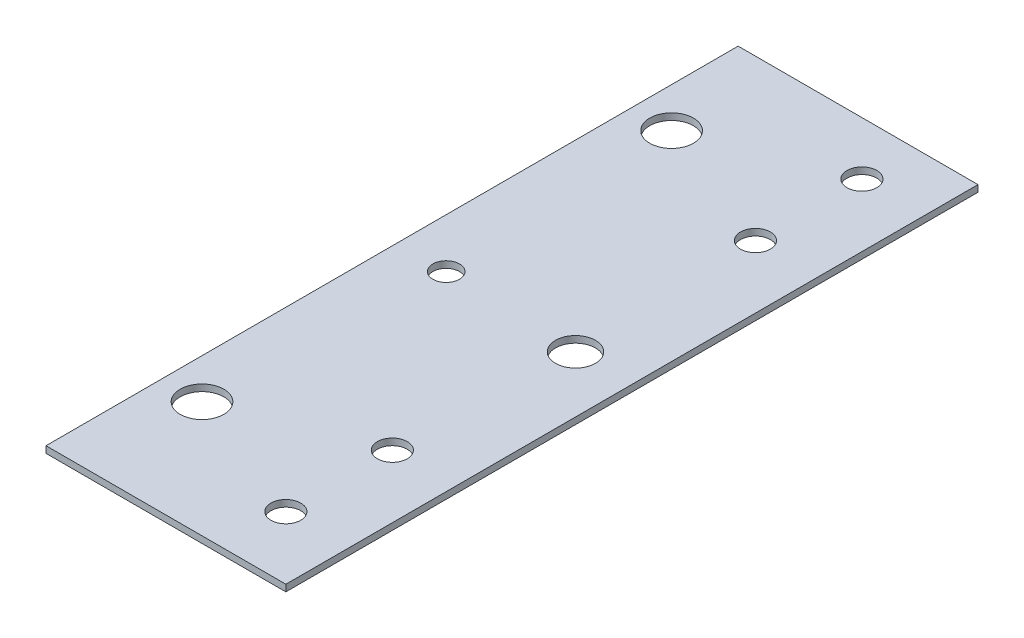
ISO-10303-21;
HEADER;
FILE_DESCRIPTION(('STEP AP214'),'2;1');
FILE_NAME('part.step','',(''),(''),'','','');
FILE_SCHEMA(('AUTOMOTIVE_DESIGN { 1 0 10303 214 1 1 1 1 }'));
ENDSEC;
DATA;
#1=APPLICATION_CONTEXT('core data for automotive mechanical design processes');
#2=APPLICATION_PROTOCOL_DEFINITION('international standard','automotive_design',2000,#1);
#3=PRODUCT_CONTEXT('',#1,'mechanical');
#4=PRODUCT('Part','Part','',(#3));
#5=PRODUCT_RELATED_PRODUCT_CATEGORY('part','',(#4));
#6=PRODUCT_DEFINITION_FORMATION('','',#4);
#7=PRODUCT_DEFINITION_CONTEXT('part definition',#1,'design');
#8=PRODUCT_DEFINITION('design','',#6,#7);
#9=PRODUCT_DEFINITION_SHAPE('','',#8);
#10=(LENGTH_UNIT() NAMED_UNIT(*) SI_UNIT(.MILLI.,.METRE.));
#11=(NAMED_UNIT(*) PLANE_ANGLE_UNIT() SI_UNIT($,.RADIAN.));
#12=(NAMED_UNIT(*) SI_UNIT($,.STERADIAN.) SOLID_ANGLE_UNIT());
#13=UNCERTAINTY_MEASURE_WITH_UNIT(LENGTH_MEASURE(1.E-05),#10,'distance_accuracy_value','');
#14=(GEOMETRIC_REPRESENTATION_CONTEXT(3) GLOBAL_UNCERTAINTY_ASSIGNED_CONTEXT((#13)) GLOBAL_UNIT_ASSIGNED_CONTEXT((#10,
#11,#12)) REPRESENTATION_CONTEXT('',''));
#15=CARTESIAN_POINT('',(0.,0.,0.));
#16=DIRECTION('',(0.,0.,1.));
#17=DIRECTION('',(1.,0.,0.));
#18=AXIS2_PLACEMENT_3D('',#15,#16,#17);
#19=CARTESIAN_POINT('',(0.,1.5875,0.));
#20=DIRECTION('',(0.,-1.,0.));
#21=DIRECTION('',(0.,0.,-1.));
#22=AXIS2_PLACEMENT_3D('',#19,#20,#21);
#23=PLANE('',#22);
#24=CARTESIAN_POINT('',(15.14475,1.5875,1.14300000000001));
#25=DIRECTION('',(0.,1.,0.));
#26=DIRECTION('',(0.,0.,1.));
#27=AXIS2_PLACEMENT_3D('',#24,#25,#26);
#28=CIRCLE('',#27,4.7625);
#29=CARTESIAN_POINT('',(15.14475,1.5875,5.90550000000001));
#30=VERTEX_POINT('',#29);
#31=EDGE_CURVE('E318',#30,#30,#28,.T.);
#32=ORIENTED_EDGE('',*,*,#31,.F.);
#33=EDGE_LOOP('',(#32));
#34=FACE_BOUND('',#33,.T.);
#35=CARTESIAN_POINT('',(-16.8498157094362,1.5875,-0.0105869799609526));
#36=DIRECTION('',(0.,1.,0.));
#37=DIRECTION('',(0.,0.,1.));
#38=AXIS2_PLACEMENT_3D('',#35,#36,#37);
#39=CIRCLE('',#38,3.175);
#40=CARTESIAN_POINT('',(-16.8498157094362,1.5875,3.16441302003905));
#41=VERTEX_POINT('',#40);
#42=EDGE_CURVE('E136',#41,#41,#39,.T.);
#43=ORIENTED_EDGE('',*,*,#42,.F.);
#44=EDGE_LOOP('',(#43));
#45=FACE_BOUND('',#44,.T.);
#46=DIRECTION('',(0.,0.,-1.));
#47=VECTOR('',#46,1.);
#48=CARTESIAN_POINT('',(28.60675,1.5875,83.693));
#49=LINE('',#48,#47);
#50=CARTESIAN_POINT('',(28.60675,1.5875,83.693));
#51=VERTEX_POINT('',#50);
#52=CARTESIAN_POINT('',(28.60675,1.5875,-81.407));
#53=VERTEX_POINT('',#52);
#54=EDGE_CURVE('E81',#51,#53,#49,.T.);
#55=ORIENTED_EDGE('',*,*,#54,.T.);
#56=DIRECTION('',(-1.,0.,0.));
#57=VECTOR('',#56,1.);
#58=CARTESIAN_POINT('',(-28.60675,1.5875,-81.407));
#59=LINE('',#58,#57);
#60=CARTESIAN_POINT('',(-28.60675,1.5875,-81.407));
#61=VERTEX_POINT('',#60);
#62=EDGE_CURVE('E84',#53,#61,#59,.T.);
#63=ORIENTED_EDGE('',*,*,#62,.T.);
#64=DIRECTION('',(0.,0.,1.));
#65=VECTOR('',#64,1.);
#66=CARTESIAN_POINT('',(-28.60675,1.5875,-81.407));
#67=LINE('',#66,#65);
#68=CARTESIAN_POINT('',(-28.60675,1.5875,83.693));
#69=VERTEX_POINT('',#68);
#70=EDGE_CURVE('E88',#61,#69,#67,.T.);
#71=ORIENTED_EDGE('',*,*,#70,.T.);
#72=DIRECTION('',(1.,0.,0.));
#73=VECTOR('',#72,1.);
#74=CARTESIAN_POINT('',(-28.60675,1.5875,83.693));
#75=LINE('',#74,#73);
#76=EDGE_CURVE('E53',#69,#51,#75,.T.);
#77=ORIENTED_EDGE('',*,*,#76,.T.);
#78=EDGE_LOOP('',(#55,#63,#71,#77));
#79=FACE_BOUND('',#78,.T.);
#80=CARTESIAN_POINT('',(-19.08175,1.5875,-56.007));
#81=DIRECTION('',(0.,1.,0.));
#82=DIRECTION('',(0.,0.,1.));
#83=AXIS2_PLACEMENT_3D('',#80,#81,#82);
#84=CIRCLE('',#83,5.207);
#85=CARTESIAN_POINT('',(-19.08175,1.5875,-50.8));
#86=VERTEX_POINT('',#85);
#87=EDGE_CURVE('E103',#86,#86,#84,.T.);
#88=ORIENTED_EDGE('',*,*,#87,.F.);
#89=EDGE_LOOP('',(#88));
#90=FACE_BOUND('',#89,.T.);
#91=CARTESIAN_POINT('',(-19.08175,1.5875,56.007));
#92=DIRECTION('',(0.,1.,0.));
#93=DIRECTION('',(0.,0.,1.));
#94=AXIS2_PLACEMENT_3D('',#91,#92,#93);
#95=CIRCLE('',#94,5.207);
#96=CARTESIAN_POINT('',(-19.08175,1.5875,61.214));
#97=VERTEX_POINT('',#96);
#98=EDGE_CURVE('E155',#97,#97,#95,.T.);
#99=ORIENTED_EDGE('',*,*,#98,.F.);
#100=EDGE_LOOP('',(#99));
#101=FACE_BOUND('',#100,.T.);
#102=CARTESIAN_POINT('',(13.62075,1.5875,-68.707));
#103=DIRECTION('',(0.,1.,0.));
#104=DIRECTION('',(0.,0.,1.));
#105=AXIS2_PLACEMENT_3D('',#102,#103,#104);
#106=CIRCLE('',#105,3.55600000000001);
#107=CARTESIAN_POINT('',(13.62075,1.5875,-65.151));
#108=VERTEX_POINT('',#107);
#109=EDGE_CURVE('E150',#108,#108,#106,.T.);
#110=ORIENTED_EDGE('',*,*,#109,.F.);
#111=EDGE_LOOP('',(#110));
#112=FACE_BOUND('',#111,.T.);
#113=CARTESIAN_POINT('',(13.62075,1.5875,-43.307));
#114=DIRECTION('',(0.,1.,0.));
#115=DIRECTION('',(0.,0.,1.));
#116=AXIS2_PLACEMENT_3D('',#113,#114,#115);
#117=CIRCLE('',#116,3.55600000000001);
#118=CARTESIAN_POINT('',(13.62075,1.5875,-39.751));
#119=VERTEX_POINT('',#118);
#120=EDGE_CURVE('E145',#119,#119,#117,.T.);
#121=ORIENTED_EDGE('',*,*,#120,.F.);
#122=EDGE_LOOP('',(#121));
#123=FACE_BOUND('',#122,.T.);
#124=CARTESIAN_POINT('',(13.62075,1.5875,43.307));
#125=DIRECTION('',(0.,1.,0.));
#126=DIRECTION('',(0.,0.,1.));
#127=AXIS2_PLACEMENT_3D('',#124,#125,#126);
#128=CIRCLE('',#127,3.55600000000001);
#129=CARTESIAN_POINT('',(13.62075,1.5875,46.863));
#130=VERTEX_POINT('',#129);
#131=EDGE_CURVE('E140',#130,#130,#128,.T.);
#132=ORIENTED_EDGE('',*,*,#131,.F.);
#133=EDGE_LOOP('',(#132));
#134=FACE_BOUND('',#133,.T.);
#135=CARTESIAN_POINT('',(13.62075,1.5875,68.707));
#136=DIRECTION('',(0.,1.,0.));
#137=DIRECTION('',(0.,0.,1.));
#138=AXIS2_PLACEMENT_3D('',#135,#136,#137);
#139=CIRCLE('',#138,3.55600000000001);
#140=CARTESIAN_POINT('',(13.62075,1.5875,72.263));
#141=VERTEX_POINT('',#140);
#142=EDGE_CURVE('E129',#141,#141,#139,.T.);
#143=ORIENTED_EDGE('',*,*,#142,.F.);
#144=EDGE_LOOP('',(#143));
#145=FACE_BOUND('',#144,.T.);
#146=ADVANCED_FACE('F35',(#34,#45,#79,#90,#101,#112,#123,#134,#145),#23,.F.);
#147=CARTESIAN_POINT('',(0.,0.,0.));
#148=DIRECTION('',(0.,-1.,0.));
#149=DIRECTION('',(0.,0.,-1.));
#150=AXIS2_PLACEMENT_3D('',#147,#148,#149);
#151=PLANE('',#150);
#152=CARTESIAN_POINT('',(15.14475,0.,1.14300000000001));
#153=DIRECTION('',(0.,-1.,0.));
#154=DIRECTION('',(0.,0.,-1.));
#155=AXIS2_PLACEMENT_3D('',#152,#153,#154);
#156=CIRCLE('',#155,4.7625);
#157=CARTESIAN_POINT('',(15.14475,0.,-3.61949999999999));
#158=VERTEX_POINT('',#157);
#159=EDGE_CURVE('E39',#158,#158,#156,.T.);
#160=ORIENTED_EDGE('',*,*,#159,.F.);
#161=EDGE_LOOP('',(#160));
#162=FACE_BOUND('',#161,.T.);
#163=CARTESIAN_POINT('',(-16.8498157094362,0.,-0.0105869799609526));
#164=DIRECTION('',(0.,1.,0.));
#165=DIRECTION('',(0.,0.,1.));
#166=AXIS2_PLACEMENT_3D('',#163,#164,#165);
#167=CIRCLE('',#166,3.175);
#168=CARTESIAN_POINT('',(-16.8498157094362,0.,3.16441302003905));
#169=VERTEX_POINT('',#168);
#170=EDGE_CURVE('E130',#169,#169,#167,.T.);
#171=ORIENTED_EDGE('',*,*,#170,.T.);
#172=EDGE_LOOP('',(#171));
#173=FACE_BOUND('',#172,.T.);
#174=CARTESIAN_POINT('',(13.62075,0.,43.307));
#175=DIRECTION('',(0.,1.,0.));
#176=DIRECTION('',(0.,0.,1.));
#177=AXIS2_PLACEMENT_3D('',#174,#175,#176);
#178=CIRCLE('',#177,3.55600000000001);
#179=CARTESIAN_POINT('',(13.62075,0.,46.863));
#180=VERTEX_POINT('',#179);
#181=EDGE_CURVE('E133',#180,#180,#178,.T.);
#182=ORIENTED_EDGE('',*,*,#181,.T.);
#183=EDGE_LOOP('',(#182));
#184=FACE_BOUND('',#183,.T.);
#185=CARTESIAN_POINT('',(13.62075,0.,-68.707));
#186=DIRECTION('',(0.,1.,0.));
#187=DIRECTION('',(0.,0.,1.));
#188=AXIS2_PLACEMENT_3D('',#185,#186,#187);
#189=CIRCLE('',#188,3.55600000000001);
#190=CARTESIAN_POINT('',(13.62075,0.,-65.151));
#191=VERTEX_POINT('',#190);
#192=EDGE_CURVE('E148',#191,#191,#189,.T.);
#193=ORIENTED_EDGE('',*,*,#192,.T.);
#194=EDGE_LOOP('',(#193));
#195=FACE_BOUND('',#194,.T.);
#196=CARTESIAN_POINT('',(-19.08175,0.,-56.007));
#197=DIRECTION('',(0.,1.,0.));
#198=DIRECTION('',(0.,0.,1.));
#199=AXIS2_PLACEMENT_3D('',#196,#197,#198);
#200=CIRCLE('',#199,5.207);
#201=CARTESIAN_POINT('',(-19.08175,0.,-50.8));
#202=VERTEX_POINT('',#201);
#203=EDGE_CURVE('E158',#202,#202,#200,.T.);
#204=ORIENTED_EDGE('',*,*,#203,.T.);
#205=EDGE_LOOP('',(#204));
#206=FACE_BOUND('',#205,.T.);
#207=DIRECTION('',(0.,0.,-1.));
#208=VECTOR('',#207,1.);
#209=CARTESIAN_POINT('',(28.60675,0.,-81.407));
#210=LINE('',#209,#208);
#211=CARTESIAN_POINT('',(28.60675,0.,83.693));
#212=VERTEX_POINT('',#211);
#213=CARTESIAN_POINT('',(28.60675,0.,-81.407));
#214=VERTEX_POINT('',#213);
#215=EDGE_CURVE('E76',#212,#214,#210,.T.);
#216=ORIENTED_EDGE('',*,*,#215,.F.);
#217=DIRECTION('',(1.,0.,0.));
#218=VECTOR('',#217,1.);
#219=CARTESIAN_POINT('',(-28.60675,0.,83.693));
#220=LINE('',#219,#218);
#221=CARTESIAN_POINT('',(-28.60675,0.,83.693));
#222=VERTEX_POINT('',#221);
#223=EDGE_CURVE('E106',#222,#212,#220,.T.);
#224=ORIENTED_EDGE('',*,*,#223,.F.);
#225=DIRECTION('',(0.,0.,1.));
#226=VECTOR('',#225,1.);
#227=CARTESIAN_POINT('',(-28.60675,0.,81.407));
#228=LINE('',#227,#226);
#229=CARTESIAN_POINT('',(-28.60675,0.,-81.407));
#230=VERTEX_POINT('',#229);
#231=EDGE_CURVE('E69',#230,#222,#228,.T.);
#232=ORIENTED_EDGE('',*,*,#231,.F.);
#233=DIRECTION('',(-1.,0.,0.));
#234=VECTOR('',#233,1.);
#235=CARTESIAN_POINT('',(-28.60675,0.,-81.407));
#236=LINE('',#235,#234);
#237=EDGE_CURVE('E93',#214,#230,#236,.T.);
#238=ORIENTED_EDGE('',*,*,#237,.F.);
#239=EDGE_LOOP('',(#216,#224,#232,#238));
#240=FACE_BOUND('',#239,.T.);
#241=CARTESIAN_POINT('',(-19.08175,0.,56.007));
#242=DIRECTION('',(0.,1.,0.));
#243=DIRECTION('',(0.,0.,1.));
#244=AXIS2_PLACEMENT_3D('',#241,#242,#243);
#245=CIRCLE('',#244,5.207);
#246=CARTESIAN_POINT('',(-19.08175,0.,61.214));
#247=VERTEX_POINT('',#246);
#248=EDGE_CURVE('E120',#247,#247,#245,.T.);
#249=ORIENTED_EDGE('',*,*,#248,.T.);
#250=EDGE_LOOP('',(#249));
#251=FACE_BOUND('',#250,.T.);
#252=CARTESIAN_POINT('',(13.62075,0.,-43.307));
#253=DIRECTION('',(0.,1.,0.));
#254=DIRECTION('',(0.,0.,1.));
#255=AXIS2_PLACEMENT_3D('',#252,#253,#254);
#256=CIRCLE('',#255,3.55600000000001);
#257=CARTESIAN_POINT('',(13.62075,0.,-39.751));
#258=VERTEX_POINT('',#257);
#259=EDGE_CURVE('E124',#258,#258,#256,.T.);
#260=ORIENTED_EDGE('',*,*,#259,.T.);
#261=EDGE_LOOP('',(#260));
#262=FACE_BOUND('',#261,.T.);
#263=CARTESIAN_POINT('',(13.62075,0.,68.707));
#264=DIRECTION('',(0.,1.,0.));
#265=DIRECTION('',(0.,0.,1.));
#266=AXIS2_PLACEMENT_3D('',#263,#264,#265);
#267=CIRCLE('',#266,3.55600000000001);
#268=CARTESIAN_POINT('',(13.62075,0.,72.263));
#269=VERTEX_POINT('',#268);
#270=EDGE_CURVE('E127',#269,#269,#267,.T.);
#271=ORIENTED_EDGE('',*,*,#270,.T.);
#272=EDGE_LOOP('',(#271));
#273=FACE_BOUND('',#272,.T.);
#274=ADVANCED_FACE('F112',(#162,#173,#184,#195,#206,#240,#251,#262,#273),#151,.T.);
#275=CARTESIAN_POINT('',(28.60675,1.5875,-81.407));
#276=DIRECTION('',(-1.,0.,0.));
#277=DIRECTION('',(0.,0.,1.));
#278=AXIS2_PLACEMENT_3D('',#275,#276,#277);
#279=PLANE('',#278);
#280=ORIENTED_EDGE('',*,*,#215,.T.);
#281=DIRECTION('',(0.,-1.,0.));
#282=VECTOR('',#281,1.);
#283=CARTESIAN_POINT('',(28.60675,1.5875,-81.407));
#284=LINE('',#283,#282);
#285=EDGE_CURVE('E11',#53,#214,#284,.T.);
#286=ORIENTED_EDGE('',*,*,#285,.F.);
#287=ORIENTED_EDGE('',*,*,#54,.F.);
#288=DIRECTION('',(0.,-1.,0.));
#289=VECTOR('',#288,1.);
#290=CARTESIAN_POINT('',(28.60675,1.5875,83.693));
#291=LINE('',#290,#289);
#292=EDGE_CURVE('E98',#51,#212,#291,.T.);
#293=ORIENTED_EDGE('',*,*,#292,.T.);
#294=EDGE_LOOP('',(#280,#286,#287,#293));
#295=FACE_BOUND('',#294,.T.);
#296=ADVANCED_FACE('F37',(#295),#279,.F.);
#297=CARTESIAN_POINT('',(-28.60675,1.5875,-81.407));
#298=DIRECTION('',(0.,0.,1.));
#299=DIRECTION('',(1.,0.,0.));
#300=AXIS2_PLACEMENT_3D('',#297,#298,#299);
#301=PLANE('',#300);
#302=ORIENTED_EDGE('',*,*,#237,.T.);
#303=DIRECTION('',(0.,-1.,0.));
#304=VECTOR('',#303,1.);
#305=CARTESIAN_POINT('',(-28.60675,1.5875,-81.407));
#306=LINE('',#305,#304);
#307=EDGE_CURVE('E45',#61,#230,#306,.T.);
#308=ORIENTED_EDGE('',*,*,#307,.F.);
#309=ORIENTED_EDGE('',*,*,#62,.F.);
#310=ORIENTED_EDGE('',*,*,#285,.T.);
#311=EDGE_LOOP('',(#302,#308,#309,#310));
#312=FACE_BOUND('',#311,.T.);
#313=ADVANCED_FACE('F92',(#312),#301,.F.);
#314=CARTESIAN_POINT('',(-28.60675,1.5875,81.407));
#315=DIRECTION('',(1.,0.,0.));
#316=DIRECTION('',(0.,0.,-1.));
#317=AXIS2_PLACEMENT_3D('',#314,#315,#316);
#318=PLANE('',#317);
#319=ORIENTED_EDGE('',*,*,#231,.T.);
#320=DIRECTION('',(0.,-1.,0.));
#321=VECTOR('',#320,1.);
#322=CARTESIAN_POINT('',(-28.60675,1.5875,83.693));
#323=LINE('',#322,#321);
#324=EDGE_CURVE('E94',#69,#222,#323,.T.);
#325=ORIENTED_EDGE('',*,*,#324,.F.);
#326=ORIENTED_EDGE('',*,*,#70,.F.);
#327=ORIENTED_EDGE('',*,*,#307,.T.);
#328=EDGE_LOOP('',(#319,#325,#326,#327));
#329=FACE_BOUND('',#328,.T.);
#330=ADVANCED_FACE('F96',(#329),#318,.F.);
#331=CARTESIAN_POINT('',(-28.60675,1.5875,83.693));
#332=DIRECTION('',(0.,0.,-1.));
#333=DIRECTION('',(-1.,0.,0.));
#334=AXIS2_PLACEMENT_3D('',#331,#332,#333);
#335=PLANE('',#334);
#336=ORIENTED_EDGE('',*,*,#223,.T.);
#337=ORIENTED_EDGE('',*,*,#292,.F.);
#338=ORIENTED_EDGE('',*,*,#76,.F.);
#339=ORIENTED_EDGE('',*,*,#324,.T.);
#340=EDGE_LOOP('',(#336,#337,#338,#339));
#341=FACE_BOUND('',#340,.T.);
#342=ADVANCED_FACE('F111',(#341),#335,.F.);
#343=CARTESIAN_POINT('',(-19.08175,1.5875,-56.007));
#344=DIRECTION('',(0.,-1.,0.));
#345=DIRECTION('',(0.,0.,-1.));
#346=AXIS2_PLACEMENT_3D('',#343,#344,#345);
#347=CYLINDRICAL_SURFACE('',#346,5.207);
#348=ORIENTED_EDGE('',*,*,#87,.T.);
#349=EDGE_LOOP('',(#348));
#350=FACE_BOUND('',#349,.T.);
#351=ORIENTED_EDGE('',*,*,#203,.F.);
#352=EDGE_LOOP('',(#351));
#353=FACE_BOUND('',#352,.T.);
#354=ADVANCED_FACE('F166',(#350,#353),#347,.F.);
#355=CARTESIAN_POINT('',(-19.08175,1.5875,56.007));
#356=DIRECTION('',(0.,-1.,0.));
#357=DIRECTION('',(0.,0.,-1.));
#358=AXIS2_PLACEMENT_3D('',#355,#356,#357);
#359=CYLINDRICAL_SURFACE('',#358,5.207);
#360=ORIENTED_EDGE('',*,*,#98,.T.);
#361=EDGE_LOOP('',(#360));
#362=FACE_BOUND('',#361,.T.);
#363=ORIENTED_EDGE('',*,*,#248,.F.);
#364=EDGE_LOOP('',(#363));
#365=FACE_BOUND('',#364,.T.);
#366=ADVANCED_FACE('F168',(#362,#365),#359,.F.);
#367=CARTESIAN_POINT('',(13.62075,1.5875,-68.707));
#368=DIRECTION('',(0.,-1.,0.));
#369=DIRECTION('',(0.,0.,-1.));
#370=AXIS2_PLACEMENT_3D('',#367,#368,#369);
#371=CYLINDRICAL_SURFACE('',#370,3.55600000000001);
#372=ORIENTED_EDGE('',*,*,#109,.T.);
#373=EDGE_LOOP('',(#372));
#374=FACE_BOUND('',#373,.T.);
#375=ORIENTED_EDGE('',*,*,#192,.F.);
#376=EDGE_LOOP('',(#375));
#377=FACE_BOUND('',#376,.T.);
#378=ADVANCED_FACE('F175',(#374,#377),#371,.F.);
#379=CARTESIAN_POINT('',(13.62075,1.5875,-43.307));
#380=DIRECTION('',(0.,-1.,0.));
#381=DIRECTION('',(0.,0.,-1.));
#382=AXIS2_PLACEMENT_3D('',#379,#380,#381);
#383=CYLINDRICAL_SURFACE('',#382,3.55600000000001);
#384=ORIENTED_EDGE('',*,*,#120,.T.);
#385=EDGE_LOOP('',(#384));
#386=FACE_BOUND('',#385,.T.);
#387=ORIENTED_EDGE('',*,*,#259,.F.);
#388=EDGE_LOOP('',(#387));
#389=FACE_BOUND('',#388,.T.);
#390=ADVANCED_FACE('F237',(#386,#389),#383,.F.);
#391=CARTESIAN_POINT('',(13.62075,1.5875,43.307));
#392=DIRECTION('',(0.,-1.,0.));
#393=DIRECTION('',(0.,0.,-1.));
#394=AXIS2_PLACEMENT_3D('',#391,#392,#393);
#395=CYLINDRICAL_SURFACE('',#394,3.55600000000001);
#396=ORIENTED_EDGE('',*,*,#131,.T.);
#397=EDGE_LOOP('',(#396));
#398=FACE_BOUND('',#397,.T.);
#399=ORIENTED_EDGE('',*,*,#181,.F.);
#400=EDGE_LOOP('',(#399));
#401=FACE_BOUND('',#400,.T.);
#402=ADVANCED_FACE('F229',(#398,#401),#395,.F.);
#403=CARTESIAN_POINT('',(13.62075,1.5875,68.707));
#404=DIRECTION('',(0.,-1.,0.));
#405=DIRECTION('',(0.,0.,-1.));
#406=AXIS2_PLACEMENT_3D('',#403,#404,#405);
#407=CYLINDRICAL_SURFACE('',#406,3.55600000000001);
#408=ORIENTED_EDGE('',*,*,#142,.T.);
#409=EDGE_LOOP('',(#408));
#410=FACE_BOUND('',#409,.T.);
#411=ORIENTED_EDGE('',*,*,#270,.F.);
#412=EDGE_LOOP('',(#411));
#413=FACE_BOUND('',#412,.T.);
#414=ADVANCED_FACE('F222',(#410,#413),#407,.F.);
#415=CARTESIAN_POINT('',(-16.8498157094362,0.,-0.0105869799609526));
#416=DIRECTION('',(0.,1.,0.));
#417=DIRECTION('',(0.,0.,1.));
#418=AXIS2_PLACEMENT_3D('',#415,#416,#417);
#419=CYLINDRICAL_SURFACE('',#418,3.175);
#420=ORIENTED_EDGE('',*,*,#170,.F.);
#421=EDGE_LOOP('',(#420));
#422=FACE_BOUND('',#421,.T.);
#423=ORIENTED_EDGE('',*,*,#42,.T.);
#424=EDGE_LOOP('',(#423));
#425=FACE_BOUND('',#424,.T.);
#426=ADVANCED_FACE('F212',(#422,#425),#419,.F.);
#427=CARTESIAN_POINT('',(15.14475,-0.9525,1.14300000000001));
#428=DIRECTION('',(0.,1.,0.));
#429=DIRECTION('',(0.,0.,1.));
#430=AXIS2_PLACEMENT_3D('',#427,#428,#429);
#431=CYLINDRICAL_SURFACE('',#430,4.7625);
#432=ORIENTED_EDGE('',*,*,#159,.T.);
#433=EDGE_LOOP('',(#432));
#434=FACE_BOUND('',#433,.T.);
#435=ORIENTED_EDGE('',*,*,#31,.T.);
#436=EDGE_LOOP('',(#435));
#437=FACE_BOUND('',#436,.T.);
#438=ADVANCED_FACE('F208',(#434,#437),#431,.F.);
#439=CLOSED_SHELL('',(#146,#274,#296,#313,#330,#342,#354,#366,#378,#390,#402,#414,#426,#438));
#440=MANIFOLD_SOLID_BREP('B2',#439);
#441=ADVANCED_BREP_SHAPE_REPRESENTATION('',(#18,#440),#14);
#442=SHAPE_DEFINITION_REPRESENTATION(#9,#441);
ENDSEC;
END-ISO-10303-21;
